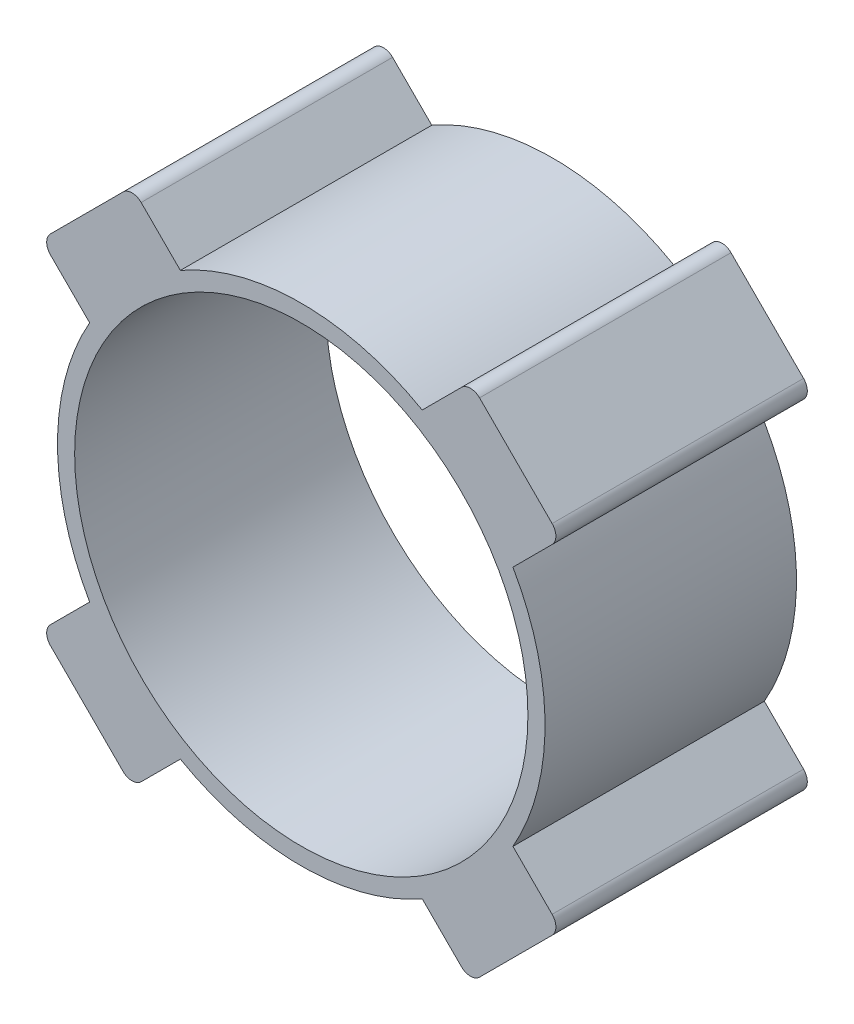
ISO-10303-21;
HEADER;
FILE_DESCRIPTION(('STEP AP214'),'2;1');
FILE_NAME('part.step','',(''),(''),'','','');
FILE_SCHEMA(('AUTOMOTIVE_DESIGN { 1 0 10303 214 1 1 1 1 }'));
ENDSEC;
DATA;
#1=APPLICATION_CONTEXT('core data for automotive mechanical design processes');
#2=APPLICATION_PROTOCOL_DEFINITION('international standard','automotive_design',2000,#1);
#3=PRODUCT_CONTEXT('',#1,'mechanical');
#4=PRODUCT('Part','Part','',(#3));
#5=PRODUCT_RELATED_PRODUCT_CATEGORY('part','',(#4));
#6=PRODUCT_DEFINITION_FORMATION('','',#4);
#7=PRODUCT_DEFINITION_CONTEXT('part definition',#1,'design');
#8=PRODUCT_DEFINITION('design','',#6,#7);
#9=PRODUCT_DEFINITION_SHAPE('','',#8);
#10=(LENGTH_UNIT() NAMED_UNIT(*) SI_UNIT(.MILLI.,.METRE.));
#11=(NAMED_UNIT(*) PLANE_ANGLE_UNIT() SI_UNIT($,.RADIAN.));
#12=(NAMED_UNIT(*) SI_UNIT($,.STERADIAN.) SOLID_ANGLE_UNIT());
#13=UNCERTAINTY_MEASURE_WITH_UNIT(LENGTH_MEASURE(1.E-05),#10,'distance_accuracy_value','');
#14=(GEOMETRIC_REPRESENTATION_CONTEXT(3) GLOBAL_UNCERTAINTY_ASSIGNED_CONTEXT((#13)) GLOBAL_UNIT_ASSIGNED_CONTEXT((#10,
#11,#12)) REPRESENTATION_CONTEXT('',''));
#15=CARTESIAN_POINT('',(0.,0.,0.));
#16=DIRECTION('',(0.,0.,1.));
#17=DIRECTION('',(1.,0.,0.));
#18=AXIS2_PLACEMENT_3D('',#15,#16,#17);
#19=CARTESIAN_POINT('',(2.933062707159,2.084534569735,3.65));
#20=DIRECTION('',(0.707106781186548,0.707106781186548,0.));
#21=DIRECTION('',(-0.707106781186548,0.707106781186548,0.));
#22=AXIS2_PLACEMENT_3D('',#19,#20,#21);
#23=PLANE('',#22);
#24=DIRECTION('',(-0.707106781186548,0.707106781186548,0.));
#25=VECTOR('',#24,1.);
#26=CARTESIAN_POINT('',(2.933062707159,2.084534569735,3.65));
#27=LINE('',#26,#25);
#28=CARTESIAN_POINT('',(2.08453456973499,2.93306270715899,3.65));
#29=VERTEX_POINT('',#28);
#30=CARTESIAN_POINT('',(2.93306270715899,2.08453456973499,3.65));
#31=VERTEX_POINT('',#30);
#32=EDGE_CURVE('E239',#29,#31,#27,.F.);
#33=ORIENTED_EDGE('',*,*,#32,.T.);
#34=DIRECTION('',(0.,0.,1.));
#35=VECTOR('',#34,1.);
#36=CARTESIAN_POINT('',(2.93306270715898,2.08453456973498,3.65));
#37=LINE('',#36,#35);
#38=CARTESIAN_POINT('',(2.93306270715899,2.08453456973499,0.71));
#39=VERTEX_POINT('',#38);
#40=EDGE_CURVE('E244',#39,#31,#37,.T.);
#41=ORIENTED_EDGE('',*,*,#40,.F.);
#42=DIRECTION('',(-0.707106781186548,0.707106781186548,0.));
#43=VECTOR('',#42,1.);
#44=CARTESIAN_POINT('',(2.933062707159,2.084534569735,0.709999999999998));
#45=LINE('',#44,#43);
#46=CARTESIAN_POINT('',(2.08453456973499,2.93306270715899,0.71));
#47=VERTEX_POINT('',#46);
#48=EDGE_CURVE('E250',#39,#47,#45,.T.);
#49=ORIENTED_EDGE('',*,*,#48,.T.);
#50=DIRECTION('',(0.,0.,1.));
#51=VECTOR('',#50,1.);
#52=CARTESIAN_POINT('',(2.08453456973498,2.93306270715898,3.65));
#53=LINE('',#52,#51);
#54=EDGE_CURVE('E252',#29,#47,#53,.F.);
#55=ORIENTED_EDGE('',*,*,#54,.F.);
#56=EDGE_LOOP('',(#33,#41,#49,#55));
#57=FACE_BOUND('',#56,.T.);
#58=ADVANCED_FACE('F17',(#57),#23,.T.);
#59=CARTESIAN_POINT('',(2.933062707159,-2.084534569735,3.65));
#60=DIRECTION('',(0.707106781186548,-0.707106781186548,0.));
#61=DIRECTION('',(0.707106781186548,0.707106781186548,0.));
#62=AXIS2_PLACEMENT_3D('',#59,#60,#61);
#63=PLANE('',#62);
#64=DIRECTION('',(0.707106781186548,0.707106781186548,0.));
#65=VECTOR('',#64,1.);
#66=CARTESIAN_POINT('',(2.933062707159,-2.084534569735,3.65));
#67=LINE('',#66,#65);
#68=CARTESIAN_POINT('',(2.93306270715899,-2.08453456973499,3.65));
#69=VERTEX_POINT('',#68);
#70=CARTESIAN_POINT('',(2.08453456973499,-2.93306270715899,3.65));
#71=VERTEX_POINT('',#70);
#72=EDGE_CURVE('E226',#69,#71,#67,.F.);
#73=ORIENTED_EDGE('',*,*,#72,.T.);
#74=DIRECTION('',(0.,0.,1.));
#75=VECTOR('',#74,1.);
#76=CARTESIAN_POINT('',(2.08453456973498,-2.93306270715898,3.65));
#77=LINE('',#76,#75);
#78=CARTESIAN_POINT('',(2.08453456973499,-2.93306270715899,0.71));
#79=VERTEX_POINT('',#78);
#80=EDGE_CURVE('E231',#79,#71,#77,.T.);
#81=ORIENTED_EDGE('',*,*,#80,.F.);
#82=DIRECTION('',(0.707106781186548,0.707106781186548,0.));
#83=VECTOR('',#82,1.);
#84=CARTESIAN_POINT('',(2.933062707159,-2.084534569735,0.709999999999998));
#85=LINE('',#84,#83);
#86=CARTESIAN_POINT('',(2.93306270715899,-2.08453456973499,0.71));
#87=VERTEX_POINT('',#86);
#88=EDGE_CURVE('E237',#79,#87,#85,.T.);
#89=ORIENTED_EDGE('',*,*,#88,.T.);
#90=DIRECTION('',(0.,0.,1.));
#91=VECTOR('',#90,1.);
#92=CARTESIAN_POINT('',(2.93306270715898,-2.08453456973498,3.65));
#93=LINE('',#92,#91);
#94=EDGE_CURVE('E240',#69,#87,#93,.F.);
#95=ORIENTED_EDGE('',*,*,#94,.F.);
#96=EDGE_LOOP('',(#73,#81,#89,#95));
#97=FACE_BOUND('',#96,.T.);
#98=ADVANCED_FACE('F462',(#97),#63,.T.);
#99=CARTESIAN_POINT('',(-2.933062707159,-2.084534569735,3.65));
#100=DIRECTION('',(-0.707106781186548,-0.707106781186548,0.));
#101=DIRECTION('',(0.707106781186548,-0.707106781186548,0.));
#102=AXIS2_PLACEMENT_3D('',#99,#100,#101);
#103=PLANE('',#102);
#104=DIRECTION('',(0.707106781186548,-0.707106781186548,0.));
#105=VECTOR('',#104,1.);
#106=CARTESIAN_POINT('',(-2.933062707159,-2.084534569735,3.65));
#107=LINE('',#106,#105);
#108=CARTESIAN_POINT('',(-2.08453456973499,-2.93306270715899,3.65));
#109=VERTEX_POINT('',#108);
#110=CARTESIAN_POINT('',(-2.93306270715899,-2.08453456973499,3.65));
#111=VERTEX_POINT('',#110);
#112=EDGE_CURVE('E217',#109,#111,#107,.F.);
#113=ORIENTED_EDGE('',*,*,#112,.T.);
#114=DIRECTION('',(0.,0.,1.));
#115=VECTOR('',#114,1.);
#116=CARTESIAN_POINT('',(-2.93306270715898,-2.08453456973498,3.65));
#117=LINE('',#116,#115);
#118=CARTESIAN_POINT('',(-2.93306270715899,-2.08453456973499,0.71));
#119=VERTEX_POINT('',#118);
#120=EDGE_CURVE('E218',#119,#111,#117,.T.);
#121=ORIENTED_EDGE('',*,*,#120,.F.);
#122=DIRECTION('',(0.707106781186548,-0.707106781186548,0.));
#123=VECTOR('',#122,1.);
#124=CARTESIAN_POINT('',(-2.933062707159,-2.084534569735,0.709999999999998));
#125=LINE('',#124,#123);
#126=CARTESIAN_POINT('',(-2.08453456973499,-2.93306270715899,0.71));
#127=VERTEX_POINT('',#126);
#128=EDGE_CURVE('E224',#119,#127,#125,.T.);
#129=ORIENTED_EDGE('',*,*,#128,.T.);
#130=DIRECTION('',(0.,0.,1.));
#131=VECTOR('',#130,1.);
#132=CARTESIAN_POINT('',(-2.08453456973498,-2.93306270715898,3.65));
#133=LINE('',#132,#131);
#134=EDGE_CURVE('E227',#109,#127,#133,.F.);
#135=ORIENTED_EDGE('',*,*,#134,.F.);
#136=EDGE_LOOP('',(#113,#121,#129,#135));
#137=FACE_BOUND('',#136,.T.);
#138=ADVANCED_FACE('F511',(#137),#103,.T.);
#139=CARTESIAN_POINT('',(-2.933062707159,2.084534569735,3.65));
#140=DIRECTION('',(-0.707106781186548,0.707106781186548,0.));
#141=DIRECTION('',(-0.707106781186548,-0.707106781186548,0.));
#142=AXIS2_PLACEMENT_3D('',#139,#140,#141);
#143=PLANE('',#142);
#144=DIRECTION('',(-0.707106781186548,-0.707106781186548,0.));
#145=VECTOR('',#144,1.);
#146=CARTESIAN_POINT('',(-2.933062707159,2.084534569735,3.65));
#147=LINE('',#146,#145);
#148=CARTESIAN_POINT('',(-2.93306270715899,2.08453456973499,3.65));
#149=VERTEX_POINT('',#148);
#150=CARTESIAN_POINT('',(-2.08453456973499,2.93306270715899,3.65));
#151=VERTEX_POINT('',#150);
#152=EDGE_CURVE('E200',#149,#151,#147,.F.);
#153=ORIENTED_EDGE('',*,*,#152,.T.);
#154=DIRECTION('',(0.,0.,1.));
#155=VECTOR('',#154,1.);
#156=CARTESIAN_POINT('',(-2.08453456973498,2.93306270715898,3.65));
#157=LINE('',#156,#155);
#158=CARTESIAN_POINT('',(-2.08453456973499,2.93306270715899,0.71));
#159=VERTEX_POINT('',#158);
#160=EDGE_CURVE('E199',#159,#151,#157,.T.);
#161=ORIENTED_EDGE('',*,*,#160,.F.);
#162=DIRECTION('',(-0.707106781186548,-0.707106781186548,0.));
#163=VECTOR('',#162,1.);
#164=CARTESIAN_POINT('',(-2.933062707159,2.084534569735,0.709999999999998));
#165=LINE('',#164,#163);
#166=CARTESIAN_POINT('',(-2.93306270715899,2.08453456973499,0.71));
#167=VERTEX_POINT('',#166);
#168=EDGE_CURVE('E195',#159,#167,#165,.T.);
#169=ORIENTED_EDGE('',*,*,#168,.T.);
#170=DIRECTION('',(0.,0.,1.));
#171=VECTOR('',#170,1.);
#172=CARTESIAN_POINT('',(-2.93306270715898,2.08453456973498,3.65));
#173=LINE('',#172,#171);
#174=EDGE_CURVE('E187',#149,#167,#173,.F.);
#175=ORIENTED_EDGE('',*,*,#174,.F.);
#176=EDGE_LOOP('',(#153,#161,#169,#175));
#177=FACE_BOUND('',#176,.T.);
#178=ADVANCED_FACE('F401',(#177),#143,.T.);
#179=CARTESIAN_POINT('',(-1.978468552557,2.826996689981,3.65));
#180=DIRECTION('',(0.,0.,1.));
#181=DIRECTION('',(1.,0.,0.));
#182=AXIS2_PLACEMENT_3D('',#179,#180,#181);
#183=CYLINDRICAL_SURFACE('',#182,0.15);
#184=CARTESIAN_POINT('',(-1.978468552557,2.826996689981,3.65));
#185=DIRECTION('',(0.,0.,1.));
#186=DIRECTION('',(1.,0.,0.));
#187=AXIS2_PLACEMENT_3D('',#184,#185,#186);
#188=CIRCLE('',#187,0.15);
#189=CARTESIAN_POINT('',(-1.872402535379,2.933062707159,3.65));
#190=VERTEX_POINT('',#189);
#191=EDGE_CURVE('E203',#151,#190,#188,.F.);
#192=ORIENTED_EDGE('',*,*,#191,.T.);
#193=DIRECTION('',(0.,0.,1.));
#194=VECTOR('',#193,1.);
#195=CARTESIAN_POINT('',(-1.872402535379,2.933062707159,3.65));
#196=LINE('',#195,#194);
#197=CARTESIAN_POINT('',(-1.872402535379,2.933062707159,0.709999999999999));
#198=VERTEX_POINT('',#197);
#199=EDGE_CURVE('E180',#198,#190,#196,.T.);
#200=ORIENTED_EDGE('',*,*,#199,.F.);
#201=CARTESIAN_POINT('',(-1.978468552557,2.826996689981,0.71));
#202=DIRECTION('',(0.,0.,1.));
#203=DIRECTION('',(1.,0.,0.));
#204=AXIS2_PLACEMENT_3D('',#201,#202,#203);
#205=CIRCLE('',#204,0.15);
#206=EDGE_CURVE('E20',#198,#159,#205,.T.);
#207=ORIENTED_EDGE('',*,*,#206,.T.);
#208=ORIENTED_EDGE('',*,*,#160,.T.);
#209=EDGE_LOOP('',(#192,#200,#207,#208));
#210=FACE_BOUND('',#209,.T.);
#211=ADVANCED_FACE('F201',(#210),#183,.T.);
#212=CARTESIAN_POINT('',(1.978468552557,2.826996689981,3.65));
#213=DIRECTION('',(0.,0.,1.));
#214=DIRECTION('',(1.,0.,0.));
#215=AXIS2_PLACEMENT_3D('',#212,#213,#214);
#216=CYLINDRICAL_SURFACE('',#215,0.15);
#217=CARTESIAN_POINT('',(1.978468552557,2.826996689981,3.65));
#218=DIRECTION('',(0.,0.,1.));
#219=DIRECTION('',(1.,0.,0.));
#220=AXIS2_PLACEMENT_3D('',#217,#218,#219);
#221=CIRCLE('',#220,0.15);
#222=CARTESIAN_POINT('',(1.872402535379,2.933062707159,3.65));
#223=VERTEX_POINT('',#222);
#224=EDGE_CURVE('E255',#223,#29,#221,.F.);
#225=ORIENTED_EDGE('',*,*,#224,.T.);
#226=ORIENTED_EDGE('',*,*,#54,.T.);
#227=CARTESIAN_POINT('',(1.978468552557,2.826996689981,0.71));
#228=DIRECTION('',(0.,0.,1.));
#229=DIRECTION('',(1.,0.,0.));
#230=AXIS2_PLACEMENT_3D('',#227,#228,#229);
#231=CIRCLE('',#230,0.15);
#232=CARTESIAN_POINT('',(1.872402535379,2.933062707159,0.709999999999999));
#233=VERTEX_POINT('',#232);
#234=EDGE_CURVE('E298',#47,#233,#231,.T.);
#235=ORIENTED_EDGE('',*,*,#234,.T.);
#236=DIRECTION('',(0.,0.,1.));
#237=VECTOR('',#236,1.);
#238=CARTESIAN_POINT('',(1.872402535379,2.933062707159,3.65));
#239=LINE('',#238,#237);
#240=EDGE_CURVE('E210',#223,#233,#239,.F.);
#241=ORIENTED_EDGE('',*,*,#240,.F.);
#242=EDGE_LOOP('',(#225,#226,#235,#241));
#243=FACE_BOUND('',#242,.T.);
#244=ADVANCED_FACE('F303',(#243),#216,.T.);
#245=CARTESIAN_POINT('',(2.826996689981,1.978468552557,3.65));
#246=DIRECTION('',(0.,0.,1.));
#247=DIRECTION('',(1.,0.,0.));
#248=AXIS2_PLACEMENT_3D('',#245,#246,#247);
#249=CYLINDRICAL_SURFACE('',#248,0.15);
#250=CARTESIAN_POINT('',(2.826996689981,1.978468552557,3.65));
#251=DIRECTION('',(0.,0.,1.));
#252=DIRECTION('',(1.,0.,0.));
#253=AXIS2_PLACEMENT_3D('',#250,#251,#252);
#254=CIRCLE('',#253,0.15);
#255=CARTESIAN_POINT('',(2.933062707159,1.872402535379,3.65));
#256=VERTEX_POINT('',#255);
#257=EDGE_CURVE('E247',#31,#256,#254,.F.);
#258=ORIENTED_EDGE('',*,*,#257,.T.);
#259=DIRECTION('',(0.,0.,1.));
#260=VECTOR('',#259,1.);
#261=CARTESIAN_POINT('',(2.933062707159,1.872402535379,3.65));
#262=LINE('',#261,#260);
#263=CARTESIAN_POINT('',(2.933062707159,1.872402535379,0.709999999999999));
#264=VERTEX_POINT('',#263);
#265=EDGE_CURVE('E338',#264,#256,#262,.T.);
#266=ORIENTED_EDGE('',*,*,#265,.F.);
#267=CARTESIAN_POINT('',(2.826996689981,1.978468552557,0.71));
#268=DIRECTION('',(0.,0.,1.));
#269=DIRECTION('',(1.,0.,0.));
#270=AXIS2_PLACEMENT_3D('',#267,#268,#269);
#271=CIRCLE('',#270,0.15);
#272=EDGE_CURVE('E248',#264,#39,#271,.T.);
#273=ORIENTED_EDGE('',*,*,#272,.T.);
#274=ORIENTED_EDGE('',*,*,#40,.T.);
#275=EDGE_LOOP('',(#258,#266,#273,#274));
#276=FACE_BOUND('',#275,.T.);
#277=ADVANCED_FACE('F501',(#276),#249,.T.);
#278=CARTESIAN_POINT('',(2.826996689981,-1.978468552557,3.65));
#279=DIRECTION('',(0.,0.,1.));
#280=DIRECTION('',(1.,0.,0.));
#281=AXIS2_PLACEMENT_3D('',#278,#279,#280);
#282=CYLINDRICAL_SURFACE('',#281,0.15);
#283=CARTESIAN_POINT('',(2.826996689981,-1.978468552557,3.65));
#284=DIRECTION('',(0.,0.,1.));
#285=DIRECTION('',(1.,0.,0.));
#286=AXIS2_PLACEMENT_3D('',#283,#284,#285);
#287=CIRCLE('',#286,0.15);
#288=CARTESIAN_POINT('',(2.933062707159,-1.872402535379,3.65));
#289=VERTEX_POINT('',#288);
#290=EDGE_CURVE('E243',#289,#69,#287,.F.);
#291=ORIENTED_EDGE('',*,*,#290,.T.);
#292=ORIENTED_EDGE('',*,*,#94,.T.);
#293=CARTESIAN_POINT('',(2.826996689981,-1.978468552557,0.71));
#294=DIRECTION('',(0.,0.,1.));
#295=DIRECTION('',(1.,0.,0.));
#296=AXIS2_PLACEMENT_3D('',#293,#294,#295);
#297=CIRCLE('',#296,0.15);
#298=CARTESIAN_POINT('',(2.933062707159,-1.872402535379,0.709999999999999));
#299=VERTEX_POINT('',#298);
#300=EDGE_CURVE('E293',#87,#299,#297,.T.);
#301=ORIENTED_EDGE('',*,*,#300,.T.);
#302=DIRECTION('',(0.,0.,1.));
#303=VECTOR('',#302,1.);
#304=CARTESIAN_POINT('',(2.933062707159,-1.872402535379,3.65));
#305=LINE('',#304,#303);
#306=EDGE_CURVE('E335',#289,#299,#305,.F.);
#307=ORIENTED_EDGE('',*,*,#306,.F.);
#308=EDGE_LOOP('',(#291,#292,#301,#307));
#309=FACE_BOUND('',#308,.T.);
#310=ADVANCED_FACE('F465',(#309),#282,.T.);
#311=CARTESIAN_POINT('',(1.978468552557,-2.826996689981,3.65));
#312=DIRECTION('',(0.,0.,1.));
#313=DIRECTION('',(1.,0.,0.));
#314=AXIS2_PLACEMENT_3D('',#311,#312,#313);
#315=CYLINDRICAL_SURFACE('',#314,0.15);
#316=CARTESIAN_POINT('',(1.978468552557,-2.826996689981,3.65));
#317=DIRECTION('',(0.,0.,1.));
#318=DIRECTION('',(1.,0.,0.));
#319=AXIS2_PLACEMENT_3D('',#316,#317,#318);
#320=CIRCLE('',#319,0.15);
#321=CARTESIAN_POINT('',(1.872402535379,-2.933062707159,3.65));
#322=VERTEX_POINT('',#321);
#323=EDGE_CURVE('E234',#71,#322,#320,.F.);
#324=ORIENTED_EDGE('',*,*,#323,.T.);
#325=DIRECTION('',(0.,0.,1.));
#326=VECTOR('',#325,1.);
#327=CARTESIAN_POINT('',(1.872402535379,-2.933062707159,3.65));
#328=LINE('',#327,#326);
#329=CARTESIAN_POINT('',(1.872402535379,-2.933062707159,0.709999999999999));
#330=VERTEX_POINT('',#329);
#331=EDGE_CURVE('E330',#330,#322,#328,.T.);
#332=ORIENTED_EDGE('',*,*,#331,.F.);
#333=CARTESIAN_POINT('',(1.978468552557,-2.826996689981,0.71));
#334=DIRECTION('',(0.,0.,1.));
#335=DIRECTION('',(1.,0.,0.));
#336=AXIS2_PLACEMENT_3D('',#333,#334,#335);
#337=CIRCLE('',#336,0.15);
#338=EDGE_CURVE('E235',#330,#79,#337,.T.);
#339=ORIENTED_EDGE('',*,*,#338,.T.);
#340=ORIENTED_EDGE('',*,*,#80,.T.);
#341=EDGE_LOOP('',(#324,#332,#339,#340));
#342=FACE_BOUND('',#341,.T.);
#343=ADVANCED_FACE('F455',(#342),#315,.T.);
#344=CARTESIAN_POINT('',(-1.978468552557,-2.826996689981,3.65));
#345=DIRECTION('',(0.,0.,1.));
#346=DIRECTION('',(1.,0.,0.));
#347=AXIS2_PLACEMENT_3D('',#344,#345,#346);
#348=CYLINDRICAL_SURFACE('',#347,0.15);
#349=CARTESIAN_POINT('',(-1.978468552557,-2.826996689981,3.65));
#350=DIRECTION('',(0.,0.,1.));
#351=DIRECTION('',(1.,0.,0.));
#352=AXIS2_PLACEMENT_3D('',#349,#350,#351);
#353=CIRCLE('',#352,0.15);
#354=CARTESIAN_POINT('',(-1.872402535379,-2.933062707159,3.65));
#355=VERTEX_POINT('',#354);
#356=EDGE_CURVE('E230',#355,#109,#353,.F.);
#357=ORIENTED_EDGE('',*,*,#356,.T.);
#358=ORIENTED_EDGE('',*,*,#134,.T.);
#359=CARTESIAN_POINT('',(-1.978468552557,-2.826996689981,0.71));
#360=DIRECTION('',(0.,0.,1.));
#361=DIRECTION('',(1.,0.,0.));
#362=AXIS2_PLACEMENT_3D('',#359,#360,#361);
#363=CIRCLE('',#362,0.15);
#364=CARTESIAN_POINT('',(-1.872402535379,-2.933062707159,0.709999999999999));
#365=VERTEX_POINT('',#364);
#366=EDGE_CURVE('E288',#127,#365,#363,.T.);
#367=ORIENTED_EDGE('',*,*,#366,.T.);
#368=DIRECTION('',(0.,0.,1.));
#369=VECTOR('',#368,1.);
#370=CARTESIAN_POINT('',(-1.872402535379,-2.933062707159,3.65));
#371=LINE('',#370,#369);
#372=EDGE_CURVE('E326',#355,#365,#371,.F.);
#373=ORIENTED_EDGE('',*,*,#372,.F.);
#374=EDGE_LOOP('',(#357,#358,#367,#373));
#375=FACE_BOUND('',#374,.T.);
#376=ADVANCED_FACE('F492',(#375),#348,.T.);
#377=CARTESIAN_POINT('',(-2.826996689981,-1.978468552557,3.65));
#378=DIRECTION('',(0.,0.,1.));
#379=DIRECTION('',(1.,0.,0.));
#380=AXIS2_PLACEMENT_3D('',#377,#378,#379);
#381=CYLINDRICAL_SURFACE('',#380,0.15);
#382=CARTESIAN_POINT('',(-2.826996689981,-1.978468552557,3.65));
#383=DIRECTION('',(0.,0.,1.));
#384=DIRECTION('',(1.,0.,0.));
#385=AXIS2_PLACEMENT_3D('',#382,#383,#384);
#386=CIRCLE('',#385,0.15);
#387=CARTESIAN_POINT('',(-2.933062707159,-1.872402535379,3.65));
#388=VERTEX_POINT('',#387);
#389=EDGE_CURVE('E221',#111,#388,#386,.F.);
#390=ORIENTED_EDGE('',*,*,#389,.T.);
#391=DIRECTION('',(0.,0.,1.));
#392=VECTOR('',#391,1.);
#393=CARTESIAN_POINT('',(-2.933062707159,-1.872402535379,3.65));
#394=LINE('',#393,#392);
#395=CARTESIAN_POINT('',(-2.933062707159,-1.872402535379,0.709999999999999));
#396=VERTEX_POINT('',#395);
#397=EDGE_CURVE('E321',#396,#388,#394,.T.);
#398=ORIENTED_EDGE('',*,*,#397,.F.);
#399=CARTESIAN_POINT('',(-2.826996689981,-1.978468552557,0.71));
#400=DIRECTION('',(0.,0.,1.));
#401=DIRECTION('',(1.,0.,0.));
#402=AXIS2_PLACEMENT_3D('',#399,#400,#401);
#403=CIRCLE('',#402,0.15);
#404=EDGE_CURVE('E222',#396,#119,#403,.T.);
#405=ORIENTED_EDGE('',*,*,#404,.T.);
#406=ORIENTED_EDGE('',*,*,#120,.T.);
#407=EDGE_LOOP('',(#390,#398,#405,#406));
#408=FACE_BOUND('',#407,.T.);
#409=ADVANCED_FACE('F489',(#408),#381,.T.);
#410=CARTESIAN_POINT('',(-2.826996689981,1.978468552557,3.65));
#411=DIRECTION('',(0.,0.,1.));
#412=DIRECTION('',(1.,0.,0.));
#413=AXIS2_PLACEMENT_3D('',#410,#411,#412);
#414=CYLINDRICAL_SURFACE('',#413,0.15);
#415=CARTESIAN_POINT('',(-2.826996689981,1.978468552557,3.65));
#416=DIRECTION('',(0.,0.,1.));
#417=DIRECTION('',(1.,0.,0.));
#418=AXIS2_PLACEMENT_3D('',#415,#416,#417);
#419=CIRCLE('',#418,0.15);
#420=CARTESIAN_POINT('',(-2.933062707159,1.872402535379,3.65));
#421=VERTEX_POINT('',#420);
#422=EDGE_CURVE('E215',#421,#149,#419,.F.);
#423=ORIENTED_EDGE('',*,*,#422,.T.);
#424=ORIENTED_EDGE('',*,*,#174,.T.);
#425=CARTESIAN_POINT('',(-2.826996689981,1.978468552557,0.71));
#426=DIRECTION('',(0.,0.,1.));
#427=DIRECTION('',(1.,0.,0.));
#428=AXIS2_PLACEMENT_3D('',#425,#426,#427);
#429=CIRCLE('',#428,0.15);
#430=CARTESIAN_POINT('',(-2.933062707159,1.872402535379,0.709999999999999));
#431=VERTEX_POINT('',#430);
#432=EDGE_CURVE('E283',#167,#431,#429,.T.);
#433=ORIENTED_EDGE('',*,*,#432,.T.);
#434=DIRECTION('',(0.,0.,1.));
#435=VECTOR('',#434,1.);
#436=CARTESIAN_POINT('',(-2.933062707159,1.872402535379,3.65));
#437=LINE('',#436,#435);
#438=EDGE_CURVE('E318',#421,#431,#437,.F.);
#439=ORIENTED_EDGE('',*,*,#438,.F.);
#440=EDGE_LOOP('',(#423,#424,#433,#439));
#441=FACE_BOUND('',#440,.T.);
#442=ADVANCED_FACE('F398',(#441),#414,.T.);
#443=CARTESIAN_POINT('',(-1.872402535379,2.933062707159,3.65));
#444=DIRECTION('',(0.707106781186548,0.707106781186548,0.));
#445=DIRECTION('',(-0.707106781186548,0.707106781186548,0.));
#446=AXIS2_PLACEMENT_3D('',#443,#444,#445);
#447=PLANE('',#446);
#448=DIRECTION('',(-0.707106781186548,0.707106781186548,0.));
#449=VECTOR('',#448,1.);
#450=CARTESIAN_POINT('',(-1.872402535379,2.933062707159,3.65));
#451=LINE('',#450,#449);
#452=CARTESIAN_POINT('',(-1.41389212363228,2.47455229541236,3.65));
#453=VERTEX_POINT('',#452);
#454=EDGE_CURVE('E204',#190,#453,#451,.F.);
#455=ORIENTED_EDGE('',*,*,#454,.T.);
#456=DIRECTION('',(0.,0.,1.));
#457=VECTOR('',#456,1.);
#458=CARTESIAN_POINT('',(-1.41389212363223,2.4745522954124,3.65));
#459=LINE('',#458,#457);
#460=CARTESIAN_POINT('',(-1.41389212363228,2.47455229541236,0.71));
#461=VERTEX_POINT('',#460);
#462=EDGE_CURVE('E183',#461,#453,#459,.T.);
#463=ORIENTED_EDGE('',*,*,#462,.F.);
#464=DIRECTION('',(-0.707106781186548,0.707106781186548,0.));
#465=VECTOR('',#464,1.);
#466=CARTESIAN_POINT('',(-1.872402535379,2.933062707159,0.709999999999998));
#467=LINE('',#466,#465);
#468=EDGE_CURVE('E176',#461,#198,#467,.T.);
#469=ORIENTED_EDGE('',*,*,#468,.T.);
#470=ORIENTED_EDGE('',*,*,#199,.T.);
#471=EDGE_LOOP('',(#455,#463,#469,#470));
#472=FACE_BOUND('',#471,.T.);
#473=ADVANCED_FACE('F178',(#472),#447,.T.);
#474=CARTESIAN_POINT('',(1.872402535379,2.933062707159,3.65));
#475=DIRECTION('',(-0.707106781186548,0.707106781186548,0.));
#476=DIRECTION('',(-0.707106781186548,-0.707106781186548,0.));
#477=AXIS2_PLACEMENT_3D('',#474,#475,#476);
#478=PLANE('',#477);
#479=DIRECTION('',(-0.707106781186548,-0.707106781186548,0.));
#480=VECTOR('',#479,1.);
#481=CARTESIAN_POINT('',(1.872402535379,2.933062707159,3.65));
#482=LINE('',#481,#480);
#483=CARTESIAN_POINT('',(1.41389212363228,2.47455229541236,3.65));
#484=VERTEX_POINT('',#483);
#485=EDGE_CURVE('E311',#484,#223,#482,.F.);
#486=ORIENTED_EDGE('',*,*,#485,.T.);
#487=ORIENTED_EDGE('',*,*,#240,.T.);
#488=DIRECTION('',(-0.707106781186548,-0.707106781186548,0.));
#489=VECTOR('',#488,1.);
#490=CARTESIAN_POINT('',(1.872402535379,2.933062707159,0.709999999999998));
#491=LINE('',#490,#489);
#492=CARTESIAN_POINT('',(1.41389212363228,2.47455229541236,0.71));
#493=VERTEX_POINT('',#492);
#494=EDGE_CURVE('E206',#233,#493,#491,.T.);
#495=ORIENTED_EDGE('',*,*,#494,.T.);
#496=DIRECTION('',(0.,0.,1.));
#497=VECTOR('',#496,1.);
#498=CARTESIAN_POINT('',(1.41389212363223,2.4745522954124,3.65));
#499=LINE('',#498,#497);
#500=EDGE_CURVE('E361',#484,#493,#499,.F.);
#501=ORIENTED_EDGE('',*,*,#500,.F.);
#502=EDGE_LOOP('',(#486,#487,#495,#501));
#503=FACE_BOUND('',#502,.T.);
#504=ADVANCED_FACE('F308',(#503),#478,.T.);
#505=CARTESIAN_POINT('',(2.933062707159,1.872402535379,3.65));
#506=DIRECTION('',(0.707106781186548,-0.707106781186548,0.));
#507=DIRECTION('',(0.707106781186548,0.707106781186548,0.));
#508=AXIS2_PLACEMENT_3D('',#505,#506,#507);
#509=PLANE('',#508);
#510=DIRECTION('',(0.707106781186548,0.707106781186548,0.));
#511=VECTOR('',#510,1.);
#512=CARTESIAN_POINT('',(2.933062707159,1.872402535379,3.65));
#513=LINE('',#512,#511);
#514=CARTESIAN_POINT('',(2.47455229541236,1.41389212363228,3.65));
#515=VERTEX_POINT('',#514);
#516=EDGE_CURVE('E340',#256,#515,#513,.F.);
#517=ORIENTED_EDGE('',*,*,#516,.T.);
#518=DIRECTION('',(0.,0.,1.));
#519=VECTOR('',#518,1.);
#520=CARTESIAN_POINT('',(2.4745522954124,1.41389212363223,3.65));
#521=LINE('',#520,#519);
#522=CARTESIAN_POINT('',(2.47455229541236,1.41389212363228,0.71));
#523=VERTEX_POINT('',#522);
#524=EDGE_CURVE('E363',#523,#515,#521,.T.);
#525=ORIENTED_EDGE('',*,*,#524,.F.);
#526=DIRECTION('',(0.707106781186548,0.707106781186548,0.));
#527=VECTOR('',#526,1.);
#528=CARTESIAN_POINT('',(2.933062707159,1.872402535379,0.709999999999998));
#529=LINE('',#528,#527);
#530=EDGE_CURVE('E313',#523,#264,#529,.T.);
#531=ORIENTED_EDGE('',*,*,#530,.T.);
#532=ORIENTED_EDGE('',*,*,#265,.T.);
#533=EDGE_LOOP('',(#517,#525,#531,#532));
#534=FACE_BOUND('',#533,.T.);
#535=ADVANCED_FACE('F474',(#534),#509,.T.);
#536=CARTESIAN_POINT('',(2.933062707159,-1.872402535379,3.65));
#537=DIRECTION('',(0.707106781186548,0.707106781186548,0.));
#538=DIRECTION('',(-0.707106781186548,0.707106781186548,0.));
#539=AXIS2_PLACEMENT_3D('',#536,#537,#538);
#540=PLANE('',#539);
#541=DIRECTION('',(-0.707106781186548,0.707106781186548,0.));
#542=VECTOR('',#541,1.);
#543=CARTESIAN_POINT('',(2.933062707159,-1.872402535379,3.65));
#544=LINE('',#543,#542);
#545=CARTESIAN_POINT('',(2.47455229541236,-1.41389212363228,3.65));
#546=VERTEX_POINT('',#545);
#547=EDGE_CURVE('E337',#546,#289,#544,.F.);
#548=ORIENTED_EDGE('',*,*,#547,.T.);
#549=ORIENTED_EDGE('',*,*,#306,.T.);
#550=DIRECTION('',(-0.707106781186548,0.707106781186548,0.));
#551=VECTOR('',#550,1.);
#552=CARTESIAN_POINT('',(2.933062707159,-1.872402535379,0.709999999999998));
#553=LINE('',#552,#551);
#554=CARTESIAN_POINT('',(2.47455229541236,-1.41389212363228,0.71));
#555=VERTEX_POINT('',#554);
#556=EDGE_CURVE('E344',#299,#555,#553,.T.);
#557=ORIENTED_EDGE('',*,*,#556,.T.);
#558=DIRECTION('',(0.,0.,1.));
#559=VECTOR('',#558,1.);
#560=CARTESIAN_POINT('',(2.4745522954124,-1.41389212363223,3.65));
#561=LINE('',#560,#559);
#562=EDGE_CURVE('E366',#546,#555,#561,.F.);
#563=ORIENTED_EDGE('',*,*,#562,.F.);
#564=EDGE_LOOP('',(#548,#549,#557,#563));
#565=FACE_BOUND('',#564,.T.);
#566=ADVANCED_FACE('F470',(#565),#540,.T.);
#567=CARTESIAN_POINT('',(1.872402535379,-2.933062707159,3.65));
#568=DIRECTION('',(-0.707106781186548,-0.707106781186548,0.));
#569=DIRECTION('',(0.707106781186548,-0.707106781186548,0.));
#570=AXIS2_PLACEMENT_3D('',#567,#568,#569);
#571=PLANE('',#570);
#572=DIRECTION('',(0.707106781186548,-0.707106781186548,0.));
#573=VECTOR('',#572,1.);
#574=CARTESIAN_POINT('',(1.872402535379,-2.933062707159,3.65));
#575=LINE('',#574,#573);
#576=CARTESIAN_POINT('',(1.41389212363228,-2.47455229541236,3.65));
#577=VERTEX_POINT('',#576);
#578=EDGE_CURVE('E333',#322,#577,#575,.F.);
#579=ORIENTED_EDGE('',*,*,#578,.T.);
#580=DIRECTION('',(0.,0.,1.));
#581=VECTOR('',#580,1.);
#582=CARTESIAN_POINT('',(1.41389212363223,-2.4745522954124,3.65));
#583=LINE('',#582,#581);
#584=CARTESIAN_POINT('',(1.41389212363228,-2.47455229541236,0.71));
#585=VERTEX_POINT('',#584);
#586=EDGE_CURVE('E369',#585,#577,#583,.T.);
#587=ORIENTED_EDGE('',*,*,#586,.F.);
#588=DIRECTION('',(0.707106781186548,-0.707106781186548,0.));
#589=VECTOR('',#588,1.);
#590=CARTESIAN_POINT('',(1.872402535379,-2.933062707159,0.709999999999998));
#591=LINE('',#590,#589);
#592=EDGE_CURVE('E334',#585,#330,#591,.T.);
#593=ORIENTED_EDGE('',*,*,#592,.T.);
#594=ORIENTED_EDGE('',*,*,#331,.T.);
#595=EDGE_LOOP('',(#579,#587,#593,#594));
#596=FACE_BOUND('',#595,.T.);
#597=ADVANCED_FACE('F453',(#596),#571,.T.);
#598=CARTESIAN_POINT('',(-1.872402535379,-2.933062707159,3.65));
#599=DIRECTION('',(0.707106781186548,-0.707106781186548,0.));
#600=DIRECTION('',(0.707106781186548,0.707106781186548,0.));
#601=AXIS2_PLACEMENT_3D('',#598,#599,#600);
#602=PLANE('',#601);
#603=DIRECTION('',(0.707106781186548,0.707106781186548,0.));
#604=VECTOR('',#603,1.);
#605=CARTESIAN_POINT('',(-1.872402535379,-2.933062707159,3.65));
#606=LINE('',#605,#604);
#607=CARTESIAN_POINT('',(-1.41389212363228,-2.47455229541236,3.65));
#608=VERTEX_POINT('',#607);
#609=EDGE_CURVE('E329',#608,#355,#606,.F.);
#610=ORIENTED_EDGE('',*,*,#609,.T.);
#611=ORIENTED_EDGE('',*,*,#372,.T.);
#612=DIRECTION('',(0.707106781186548,0.707106781186548,0.));
#613=VECTOR('',#612,1.);
#614=CARTESIAN_POINT('',(-1.872402535379,-2.933062707159,0.709999999999998));
#615=LINE('',#614,#613);
#616=CARTESIAN_POINT('',(-1.41389212363228,-2.47455229541236,0.71));
#617=VERTEX_POINT('',#616);
#618=EDGE_CURVE('E352',#365,#617,#615,.T.);
#619=ORIENTED_EDGE('',*,*,#618,.T.);
#620=DIRECTION('',(0.,0.,1.));
#621=VECTOR('',#620,1.);
#622=CARTESIAN_POINT('',(-1.41389212363223,-2.4745522954124,3.65));
#623=LINE('',#622,#621);
#624=EDGE_CURVE('E372',#608,#617,#623,.F.);
#625=ORIENTED_EDGE('',*,*,#624,.F.);
#626=EDGE_LOOP('',(#610,#611,#619,#625));
#627=FACE_BOUND('',#626,.T.);
#628=ADVANCED_FACE('F446',(#627),#602,.T.);
#629=CARTESIAN_POINT('',(-2.933062707159,-1.872402535379,3.65));
#630=DIRECTION('',(-0.707106781186548,0.707106781186548,0.));
#631=DIRECTION('',(-0.707106781186548,-0.707106781186548,0.));
#632=AXIS2_PLACEMENT_3D('',#629,#630,#631);
#633=PLANE('',#632);
#634=DIRECTION('',(-0.707106781186548,-0.707106781186548,0.));
#635=VECTOR('',#634,1.);
#636=CARTESIAN_POINT('',(-2.933062707159,-1.872402535379,3.65));
#637=LINE('',#636,#635);
#638=CARTESIAN_POINT('',(-2.47455229541236,-1.41389212363228,3.65));
#639=VERTEX_POINT('',#638);
#640=EDGE_CURVE('E324',#388,#639,#637,.F.);
#641=ORIENTED_EDGE('',*,*,#640,.T.);
#642=DIRECTION('',(0.,0.,1.));
#643=VECTOR('',#642,1.);
#644=CARTESIAN_POINT('',(-2.4745522954124,-1.41389212363223,3.65));
#645=LINE('',#644,#643);
#646=CARTESIAN_POINT('',(-2.47455229541236,-1.41389212363228,0.71));
#647=VERTEX_POINT('',#646);
#648=EDGE_CURVE('E375',#647,#639,#645,.T.);
#649=ORIENTED_EDGE('',*,*,#648,.F.);
#650=DIRECTION('',(-0.707106781186548,-0.707106781186548,0.));
#651=VECTOR('',#650,1.);
#652=CARTESIAN_POINT('',(-2.933062707159,-1.872402535379,0.709999999999998));
#653=LINE('',#652,#651);
#654=EDGE_CURVE('E325',#647,#396,#653,.T.);
#655=ORIENTED_EDGE('',*,*,#654,.T.);
#656=ORIENTED_EDGE('',*,*,#397,.T.);
#657=EDGE_LOOP('',(#641,#649,#655,#656));
#658=FACE_BOUND('',#657,.T.);
#659=ADVANCED_FACE('F387',(#658),#633,.T.);
#660=CARTESIAN_POINT('',(-2.933062707159,1.872402535379,3.65));
#661=DIRECTION('',(-0.707106781186548,-0.707106781186548,0.));
#662=DIRECTION('',(0.707106781186548,-0.707106781186548,0.));
#663=AXIS2_PLACEMENT_3D('',#660,#661,#662);
#664=PLANE('',#663);
#665=DIRECTION('',(0.707106781186548,-0.707106781186548,0.));
#666=VECTOR('',#665,1.);
#667=CARTESIAN_POINT('',(-2.933062707159,1.872402535379,3.65));
#668=LINE('',#667,#666);
#669=CARTESIAN_POINT('',(-2.47455229541236,1.41389212363228,3.65));
#670=VERTEX_POINT('',#669);
#671=EDGE_CURVE('E320',#670,#421,#668,.F.);
#672=ORIENTED_EDGE('',*,*,#671,.T.);
#673=ORIENTED_EDGE('',*,*,#438,.T.);
#674=DIRECTION('',(0.707106781186548,-0.707106781186548,0.));
#675=VECTOR('',#674,1.);
#676=CARTESIAN_POINT('',(-2.933062707159,1.872402535379,0.709999999999998));
#677=LINE('',#676,#675);
#678=CARTESIAN_POINT('',(-2.47455229541236,1.41389212363228,0.71));
#679=VERTEX_POINT('',#678);
#680=EDGE_CURVE('E35',#431,#679,#677,.T.);
#681=ORIENTED_EDGE('',*,*,#680,.T.);
#682=DIRECTION('',(0.,0.,1.));
#683=VECTOR('',#682,1.);
#684=CARTESIAN_POINT('',(-2.4745522954124,1.41389212363223,3.65));
#685=LINE('',#684,#683);
#686=EDGE_CURVE('E281',#670,#679,#685,.F.);
#687=ORIENTED_EDGE('',*,*,#686,.F.);
#688=EDGE_LOOP('',(#672,#673,#681,#687));
#689=FACE_BOUND('',#688,.T.);
#690=ADVANCED_FACE('F396',(#689),#664,.T.);
#691=CARTESIAN_POINT('',(0.,0.,3.65));
#692=DIRECTION('',(0.,0.,1.));
#693=DIRECTION('',(1.,0.,0.));
#694=AXIS2_PLACEMENT_3D('',#691,#692,#693);
#695=CYLINDRICAL_SURFACE('',#694,2.85);
#696=CARTESIAN_POINT('',(0.,0.,3.65));
#697=DIRECTION('',(0.,0.,1.));
#698=DIRECTION('',(1.,0.,0.));
#699=AXIS2_PLACEMENT_3D('',#696,#697,#698);
#700=CIRCLE('',#699,2.85);
#701=EDGE_CURVE('E278',#453,#484,#700,.F.);
#702=ORIENTED_EDGE('',*,*,#701,.T.);
#703=ORIENTED_EDGE('',*,*,#500,.T.);
#704=CARTESIAN_POINT('',(0.,0.,0.71));
#705=DIRECTION('',(0.,0.,1.));
#706=DIRECTION('',(1.,0.,0.));
#707=AXIS2_PLACEMENT_3D('',#704,#705,#706);
#708=CIRCLE('',#707,2.85);
#709=EDGE_CURVE('E267',#461,#493,#708,.F.);
#710=ORIENTED_EDGE('',*,*,#709,.F.);
#711=ORIENTED_EDGE('',*,*,#462,.T.);
#712=EDGE_LOOP('',(#702,#703,#710,#711));
#713=FACE_BOUND('',#712,.T.);
#714=ADVANCED_FACE('F404',(#713),#695,.T.);
#715=CARTESIAN_POINT('',(0.,0.,3.65));
#716=DIRECTION('',(0.,0.,1.));
#717=DIRECTION('',(1.,0.,0.));
#718=AXIS2_PLACEMENT_3D('',#715,#716,#717);
#719=CYLINDRICAL_SURFACE('',#718,2.85);
#720=CARTESIAN_POINT('',(0.,0.,3.65));
#721=DIRECTION('',(0.,0.,1.));
#722=DIRECTION('',(1.,0.,0.));
#723=AXIS2_PLACEMENT_3D('',#720,#721,#722);
#724=CIRCLE('',#723,2.85);
#725=EDGE_CURVE('E275',#515,#546,#724,.F.);
#726=ORIENTED_EDGE('',*,*,#725,.T.);
#727=ORIENTED_EDGE('',*,*,#562,.T.);
#728=CARTESIAN_POINT('',(0.,0.,0.71));
#729=DIRECTION('',(0.,0.,1.));
#730=DIRECTION('',(1.,0.,0.));
#731=AXIS2_PLACEMENT_3D('',#728,#729,#730);
#732=CIRCLE('',#731,2.85);
#733=EDGE_CURVE('E264',#523,#555,#732,.F.);
#734=ORIENTED_EDGE('',*,*,#733,.F.);
#735=ORIENTED_EDGE('',*,*,#524,.T.);
#736=EDGE_LOOP('',(#726,#727,#734,#735));
#737=FACE_BOUND('',#736,.T.);
#738=ADVANCED_FACE('F406',(#737),#719,.T.);
#739=CARTESIAN_POINT('',(0.,0.,3.65));
#740=DIRECTION('',(0.,0.,1.));
#741=DIRECTION('',(1.,0.,0.));
#742=AXIS2_PLACEMENT_3D('',#739,#740,#741);
#743=CYLINDRICAL_SURFACE('',#742,2.85);
#744=CARTESIAN_POINT('',(0.,0.,3.65));
#745=DIRECTION('',(0.,0.,1.));
#746=DIRECTION('',(1.,0.,0.));
#747=AXIS2_PLACEMENT_3D('',#744,#745,#746);
#748=CIRCLE('',#747,2.85);
#749=EDGE_CURVE('E272',#577,#608,#748,.F.);
#750=ORIENTED_EDGE('',*,*,#749,.T.);
#751=ORIENTED_EDGE('',*,*,#624,.T.);
#752=CARTESIAN_POINT('',(0.,0.,0.71));
#753=DIRECTION('',(0.,0.,1.));
#754=DIRECTION('',(1.,0.,0.));
#755=AXIS2_PLACEMENT_3D('',#752,#753,#754);
#756=CIRCLE('',#755,2.85);
#757=EDGE_CURVE('E261',#585,#617,#756,.F.);
#758=ORIENTED_EDGE('',*,*,#757,.F.);
#759=ORIENTED_EDGE('',*,*,#586,.T.);
#760=EDGE_LOOP('',(#750,#751,#758,#759));
#761=FACE_BOUND('',#760,.T.);
#762=ADVANCED_FACE('F413',(#761),#743,.T.);
#763=CARTESIAN_POINT('',(0.,0.,3.65));
#764=DIRECTION('',(0.,0.,1.));
#765=DIRECTION('',(1.,0.,0.));
#766=AXIS2_PLACEMENT_3D('',#763,#764,#765);
#767=CYLINDRICAL_SURFACE('',#766,2.85);
#768=CARTESIAN_POINT('',(0.,0.,3.65));
#769=DIRECTION('',(0.,0.,1.));
#770=DIRECTION('',(1.,0.,0.));
#771=AXIS2_PLACEMENT_3D('',#768,#769,#770);
#772=CIRCLE('',#771,2.85);
#773=EDGE_CURVE('E269',#639,#670,#772,.F.);
#774=ORIENTED_EDGE('',*,*,#773,.T.);
#775=ORIENTED_EDGE('',*,*,#686,.T.);
#776=CARTESIAN_POINT('',(0.,0.,0.71));
#777=DIRECTION('',(0.,0.,1.));
#778=DIRECTION('',(1.,0.,0.));
#779=AXIS2_PLACEMENT_3D('',#776,#777,#778);
#780=CIRCLE('',#779,2.85);
#781=EDGE_CURVE('E259',#647,#679,#780,.F.);
#782=ORIENTED_EDGE('',*,*,#781,.F.);
#783=ORIENTED_EDGE('',*,*,#648,.T.);
#784=EDGE_LOOP('',(#774,#775,#782,#783));
#785=FACE_BOUND('',#784,.T.);
#786=ADVANCED_FACE('F380',(#785),#767,.T.);
#787=CARTESIAN_POINT('',(-2.826996689981,1.978468552557,3.65));
#788=DIRECTION('',(0.,0.,-1.));
#789=DIRECTION('',(-1.,0.,0.));
#790=AXIS2_PLACEMENT_3D('',#787,#788,#789);
#791=PLANE('',#790);
#792=ORIENTED_EDGE('',*,*,#671,.F.);
#793=ORIENTED_EDGE('',*,*,#773,.F.);
#794=ORIENTED_EDGE('',*,*,#640,.F.);
#795=ORIENTED_EDGE('',*,*,#389,.F.);
#796=ORIENTED_EDGE('',*,*,#112,.F.);
#797=ORIENTED_EDGE('',*,*,#356,.F.);
#798=ORIENTED_EDGE('',*,*,#609,.F.);
#799=ORIENTED_EDGE('',*,*,#749,.F.);
#800=ORIENTED_EDGE('',*,*,#578,.F.);
#801=ORIENTED_EDGE('',*,*,#323,.F.);
#802=ORIENTED_EDGE('',*,*,#72,.F.);
#803=ORIENTED_EDGE('',*,*,#290,.F.);
#804=ORIENTED_EDGE('',*,*,#547,.F.);
#805=ORIENTED_EDGE('',*,*,#725,.F.);
#806=ORIENTED_EDGE('',*,*,#516,.F.);
#807=ORIENTED_EDGE('',*,*,#257,.F.);
#808=ORIENTED_EDGE('',*,*,#32,.F.);
#809=ORIENTED_EDGE('',*,*,#224,.F.);
#810=ORIENTED_EDGE('',*,*,#485,.F.);
#811=ORIENTED_EDGE('',*,*,#701,.F.);
#812=ORIENTED_EDGE('',*,*,#454,.F.);
#813=ORIENTED_EDGE('',*,*,#191,.F.);
#814=ORIENTED_EDGE('',*,*,#152,.F.);
#815=ORIENTED_EDGE('',*,*,#422,.F.);
#816=EDGE_LOOP('',(#792,#793,#794,#795,#796,#797,#798,#799,#800,#801,#802,#803,#804,#805,#806,
#807,#808,#809,#810,#811,#812,#813,#814,#815));
#817=FACE_BOUND('',#816,.T.);
#818=CARTESIAN_POINT('',(0.,0.,3.65));
#819=DIRECTION('',(0.,0.,1.));
#820=DIRECTION('',(1.,0.,0.));
#821=AXIS2_PLACEMENT_3D('',#818,#819,#820);
#822=CIRCLE('',#821,2.65);
#823=CARTESIAN_POINT('',(2.65,0.,3.65));
#824=VERTEX_POINT('',#823);
#825=EDGE_CURVE('E26',#824,#824,#822,.F.);
#826=ORIENTED_EDGE('',*,*,#825,.T.);
#827=EDGE_LOOP('',(#826));
#828=FACE_BOUND('',#827,.T.);
#829=ADVANCED_FACE('F390',(#817,#828),#791,.F.);
#830=CARTESIAN_POINT('',(-2.826996689981,1.978468552557,0.71));
#831=DIRECTION('',(0.,0.,-1.));
#832=DIRECTION('',(-1.,0.,0.));
#833=AXIS2_PLACEMENT_3D('',#830,#831,#832);
#834=PLANE('',#833);
#835=ORIENTED_EDGE('',*,*,#781,.T.);
#836=ORIENTED_EDGE('',*,*,#680,.F.);
#837=ORIENTED_EDGE('',*,*,#432,.F.);
#838=ORIENTED_EDGE('',*,*,#168,.F.);
#839=ORIENTED_EDGE('',*,*,#206,.F.);
#840=ORIENTED_EDGE('',*,*,#468,.F.);
#841=ORIENTED_EDGE('',*,*,#709,.T.);
#842=ORIENTED_EDGE('',*,*,#494,.F.);
#843=ORIENTED_EDGE('',*,*,#234,.F.);
#844=ORIENTED_EDGE('',*,*,#48,.F.);
#845=ORIENTED_EDGE('',*,*,#272,.F.);
#846=ORIENTED_EDGE('',*,*,#530,.F.);
#847=ORIENTED_EDGE('',*,*,#733,.T.);
#848=ORIENTED_EDGE('',*,*,#556,.F.);
#849=ORIENTED_EDGE('',*,*,#300,.F.);
#850=ORIENTED_EDGE('',*,*,#88,.F.);
#851=ORIENTED_EDGE('',*,*,#338,.F.);
#852=ORIENTED_EDGE('',*,*,#592,.F.);
#853=ORIENTED_EDGE('',*,*,#757,.T.);
#854=ORIENTED_EDGE('',*,*,#618,.F.);
#855=ORIENTED_EDGE('',*,*,#366,.F.);
#856=ORIENTED_EDGE('',*,*,#128,.F.);
#857=ORIENTED_EDGE('',*,*,#404,.F.);
#858=ORIENTED_EDGE('',*,*,#654,.F.);
#859=EDGE_LOOP('',(#835,#836,#837,#838,#839,#840,#841,#842,#843,#844,#845,#846,#847,#848,#849,
#850,#851,#852,#853,#854,#855,#856,#857,#858));
#860=FACE_BOUND('',#859,.T.);
#861=CARTESIAN_POINT('',(0.,0.,0.71));
#862=DIRECTION('',(0.,0.,1.));
#863=DIRECTION('',(1.,0.,0.));
#864=AXIS2_PLACEMENT_3D('',#861,#862,#863);
#865=CIRCLE('',#864,2.65);
#866=CARTESIAN_POINT('',(2.65,0.,0.71));
#867=VERTEX_POINT('',#866);
#868=EDGE_CURVE('E11',#867,#867,#865,.T.);
#869=ORIENTED_EDGE('',*,*,#868,.T.);
#870=EDGE_LOOP('',(#869));
#871=FACE_BOUND('',#870,.T.);
#872=ADVANCED_FACE('F192',(#860,#871),#834,.T.);
#873=CARTESIAN_POINT('',(0.,0.,3.65));
#874=DIRECTION('',(0.,0.,1.));
#875=DIRECTION('',(1.,0.,0.));
#876=AXIS2_PLACEMENT_3D('',#873,#874,#875);
#877=CYLINDRICAL_SURFACE('',#876,2.65);
#878=ORIENTED_EDGE('',*,*,#868,.F.);
#879=EDGE_LOOP('',(#878));
#880=FACE_BOUND('',#879,.T.);
#881=ORIENTED_EDGE('',*,*,#825,.F.);
#882=EDGE_LOOP('',(#881));
#883=FACE_BOUND('',#882,.T.);
#884=ADVANCED_FACE('F417',(#880,#883),#877,.F.);
#885=CLOSED_SHELL('',(#58,#98,#138,#178,#211,#244,#277,#310,#343,#376,#409,#442,#473,#504,#535,
#566,#597,#628,#659,#690,#714,#738,#762,#786,#829,#872,#884));
#886=MANIFOLD_SOLID_BREP('B1',#885);
#887=ADVANCED_BREP_SHAPE_REPRESENTATION('',(#18,#886),#14);
#888=SHAPE_DEFINITION_REPRESENTATION(#9,#887);
ENDSEC;
END-ISO-10303-21;
